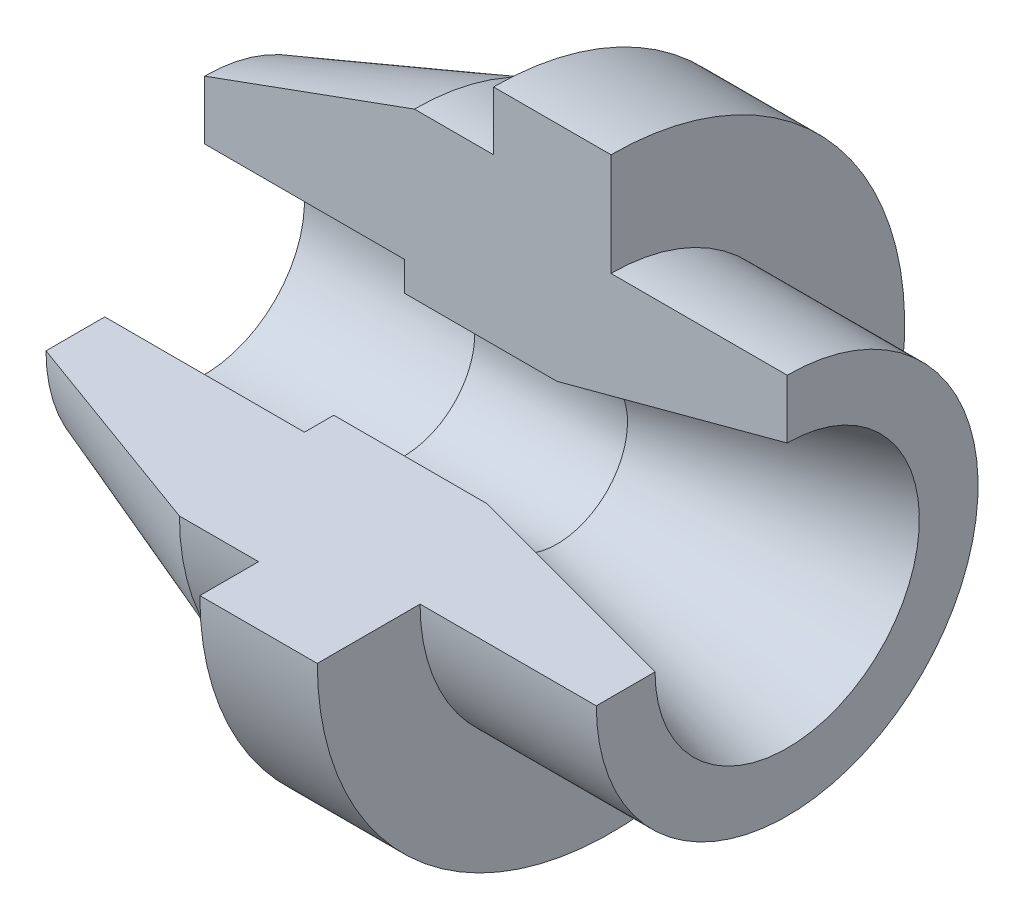
ISO-10303-21;
HEADER;
FILE_DESCRIPTION(('STEP AP214'),'2;1');
FILE_NAME('part.step','',(''),(''),'','','');
FILE_SCHEMA(('AUTOMOTIVE_DESIGN { 1 0 10303 214 1 1 1 1 }'));
ENDSEC;
DATA;
#1=APPLICATION_CONTEXT('core data for automotive mechanical design processes');
#2=APPLICATION_PROTOCOL_DEFINITION('international standard','automotive_design',2000,#1);
#3=PRODUCT_CONTEXT('',#1,'mechanical');
#4=PRODUCT('Part','Part','',(#3));
#5=PRODUCT_RELATED_PRODUCT_CATEGORY('part','',(#4));
#6=PRODUCT_DEFINITION_FORMATION('','',#4);
#7=PRODUCT_DEFINITION_CONTEXT('part definition',#1,'design');
#8=PRODUCT_DEFINITION('design','',#6,#7);
#9=PRODUCT_DEFINITION_SHAPE('','',#8);
#10=(LENGTH_UNIT() NAMED_UNIT(*) SI_UNIT(.MILLI.,.METRE.));
#11=(NAMED_UNIT(*) PLANE_ANGLE_UNIT() SI_UNIT($,.RADIAN.));
#12=(NAMED_UNIT(*) SI_UNIT($,.STERADIAN.) SOLID_ANGLE_UNIT());
#13=UNCERTAINTY_MEASURE_WITH_UNIT(LENGTH_MEASURE(1.E-05),#10,'distance_accuracy_value','');
#14=(GEOMETRIC_REPRESENTATION_CONTEXT(3) GLOBAL_UNCERTAINTY_ASSIGNED_CONTEXT((#13)) GLOBAL_UNIT_ASSIGNED_CONTEXT((#10,
#11,#12)) REPRESENTATION_CONTEXT('',''));
#15=CARTESIAN_POINT('',(0.,0.,0.));
#16=DIRECTION('',(0.,0.,1.));
#17=DIRECTION('',(1.,0.,0.));
#18=AXIS2_PLACEMENT_3D('',#15,#16,#17);
#19=CARTESIAN_POINT('',(0.,0.,0.));
#20=DIRECTION('',(-1.,0.,0.));
#21=DIRECTION('',(0.,0.,1.));
#22=AXIS2_PLACEMENT_3D('',#19,#20,#21);
#23=CYLINDRICAL_SURFACE('',#22,17.);
#24=CARTESIAN_POINT('',(0.,0.,0.));
#25=DIRECTION('',(-1.,0.,0.));
#26=DIRECTION('',(0.,0.,1.));
#27=AXIS2_PLACEMENT_3D('',#24,#25,#26);
#28=CIRCLE('',#27,17.);
#29=CARTESIAN_POINT('',(0.,17.,1.78065548281E-13));
#30=VERTEX_POINT('',#29);
#31=CARTESIAN_POINT('',(0.,0.,17.));
#32=VERTEX_POINT('',#31);
#33=EDGE_CURVE('E11',#30,#32,#28,.T.);
#34=ORIENTED_EDGE('',*,*,#33,.T.);
#35=DIRECTION('',(-1.,0.,0.));
#36=VECTOR('',#35,1.);
#37=CARTESIAN_POINT('',(34.,0.,17.));
#38=LINE('',#37,#36);
#39=CARTESIAN_POINT('',(34.,0.,17.));
#40=VERTEX_POINT('',#39);
#41=EDGE_CURVE('E132',#40,#32,#38,.T.);
#42=ORIENTED_EDGE('',*,*,#41,.F.);
#43=CARTESIAN_POINT('',(34.,0.,0.));
#44=DIRECTION('',(-1.,0.,0.));
#45=DIRECTION('',(0.,0.,1.));
#46=AXIS2_PLACEMENT_3D('',#43,#44,#45);
#47=CIRCLE('',#46,17.);
#48=CARTESIAN_POINT('',(34.,17.,1.78065548281E-13));
#49=VERTEX_POINT('',#48);
#50=EDGE_CURVE('E59',#49,#40,#47,.T.);
#51=ORIENTED_EDGE('',*,*,#50,.F.);
#52=DIRECTION('',(-1.,0.,0.));
#53=VECTOR('',#52,1.);
#54=CARTESIAN_POINT('',(34.,17.,1.78065548281E-13));
#55=LINE('',#54,#53);
#56=EDGE_CURVE('E134',#49,#30,#55,.T.);
#57=ORIENTED_EDGE('',*,*,#56,.T.);
#58=EDGE_LOOP('',(#34,#42,#51,#57));
#59=FACE_BOUND('',#58,.T.);
#60=ADVANCED_FACE('F43',(#59),#23,.F.);
#61=CARTESIAN_POINT('',(0.,17.,1.78065548281E-13));
#62=DIRECTION('',(-1.,0.,0.));
#63=DIRECTION('',(0.,0.,1.));
#64=AXIS2_PLACEMENT_3D('',#61,#62,#63);
#65=PLANE('',#64);
#66=CARTESIAN_POINT('',(0.,0.,0.));
#67=DIRECTION('',(-1.,0.,0.));
#68=DIRECTION('',(0.,0.,1.));
#69=AXIS2_PLACEMENT_3D('',#66,#67,#68);
#70=CIRCLE('',#69,27.);
#71=CARTESIAN_POINT('',(0.,27.,2.82809988446294E-13));
#72=VERTEX_POINT('',#71);
#73=CARTESIAN_POINT('',(0.,0.,27.));
#74=VERTEX_POINT('',#73);
#75=EDGE_CURVE('E52',#72,#74,#70,.T.);
#76=ORIENTED_EDGE('',*,*,#75,.T.);
#77=DIRECTION('',(0.,0.,1.));
#78=VECTOR('',#77,1.);
#79=CARTESIAN_POINT('',(0.,0.,17.));
#80=LINE('',#79,#78);
#81=EDGE_CURVE('E143',#32,#74,#80,.T.);
#82=ORIENTED_EDGE('',*,*,#81,.F.);
#83=ORIENTED_EDGE('',*,*,#33,.F.);
#84=DIRECTION('',(0.,1.,0.));
#85=VECTOR('',#84,1.);
#86=CARTESIAN_POINT('',(0.,17.,1.78065548281E-13));
#87=LINE('',#86,#85);
#88=EDGE_CURVE('E190',#30,#72,#87,.T.);
#89=ORIENTED_EDGE('',*,*,#88,.T.);
#90=EDGE_LOOP('',(#76,#82,#83,#89));
#91=FACE_BOUND('',#90,.T.);
#92=ADVANCED_FACE('F45',(#91),#65,.T.);
#93=CARTESIAN_POINT('',(0.,0.,0.));
#94=DIRECTION('',(1.,0.,0.));
#95=DIRECTION('',(0.,0.,-1.));
#96=AXIS2_PLACEMENT_3D('',#93,#94,#95);
#97=CONICAL_SURFACE('',#96,27.,0.349065850398862);
#98=CARTESIAN_POINT('',(35.7172064529105,0.,0.));
#99=DIRECTION('',(-1.,0.,0.));
#100=DIRECTION('',(0.,0.,1.));
#101=AXIS2_PLACEMENT_3D('',#98,#99,#100);
#102=CIRCLE('',#101,40.);
#103=CARTESIAN_POINT('',(35.7172064529105,40.,4.18977760661176E-13));
#104=VERTEX_POINT('',#103);
#105=CARTESIAN_POINT('',(35.7172064529105,0.,40.));
#106=VERTEX_POINT('',#105);
#107=EDGE_CURVE('E256',#104,#106,#102,.T.);
#108=ORIENTED_EDGE('',*,*,#107,.T.);
#109=DIRECTION('',(0.93969262078591,0.,0.342020143325665));
#110=VECTOR('',#109,1.);
#111=CARTESIAN_POINT('',(0.,0.,27.));
#112=LINE('',#111,#110);
#113=EDGE_CURVE('E150',#74,#106,#112,.T.);
#114=ORIENTED_EDGE('',*,*,#113,.F.);
#115=ORIENTED_EDGE('',*,*,#75,.F.);
#116=DIRECTION('',(0.93969262078591,0.342020143325665,0.));
#117=VECTOR('',#116,1.);
#118=CARTESIAN_POINT('',(0.,27.,2.82809988446294E-13));
#119=LINE('',#118,#117);
#120=EDGE_CURVE('E193',#72,#104,#119,.T.);
#121=ORIENTED_EDGE('',*,*,#120,.T.);
#122=EDGE_LOOP('',(#108,#114,#115,#121));
#123=FACE_BOUND('',#122,.T.);
#124=ADVANCED_FACE('F260',(#123),#97,.T.);
#125=CARTESIAN_POINT('',(0.,0.,0.));
#126=DIRECTION('',(-1.,0.,0.));
#127=DIRECTION('',(0.,0.,1.));
#128=AXIS2_PLACEMENT_3D('',#125,#126,#127);
#129=CYLINDRICAL_SURFACE('',#128,40.);
#130=CARTESIAN_POINT('',(49.1865334794743,0.,0.));
#131=DIRECTION('',(-1.,0.,0.));
#132=DIRECTION('',(0.,0.,1.));
#133=AXIS2_PLACEMENT_3D('',#130,#131,#132);
#134=CIRCLE('',#133,40.);
#135=CARTESIAN_POINT('',(49.1865334794743,40.,4.18977760661176E-13));
#136=VERTEX_POINT('',#135);
#137=CARTESIAN_POINT('',(49.1865334794743,0.,40.));
#138=VERTEX_POINT('',#137);
#139=EDGE_CURVE('E253',#136,#138,#134,.T.);
#140=ORIENTED_EDGE('',*,*,#139,.T.);
#141=DIRECTION('',(1.,0.,0.));
#142=VECTOR('',#141,1.);
#143=CARTESIAN_POINT('',(35.7172064529105,0.,40.));
#144=LINE('',#143,#142);
#145=EDGE_CURVE('E153',#106,#138,#144,.T.);
#146=ORIENTED_EDGE('',*,*,#145,.F.);
#147=ORIENTED_EDGE('',*,*,#107,.F.);
#148=DIRECTION('',(1.,0.,0.));
#149=VECTOR('',#148,1.);
#150=CARTESIAN_POINT('',(35.7172064529105,40.,4.18977760661176E-13));
#151=LINE('',#150,#149);
#152=EDGE_CURVE('E197',#104,#136,#151,.T.);
#153=ORIENTED_EDGE('',*,*,#152,.T.);
#154=EDGE_LOOP('',(#140,#146,#147,#153));
#155=FACE_BOUND('',#154,.T.);
#156=ADVANCED_FACE('F266',(#155),#129,.T.);
#157=CARTESIAN_POINT('',(49.1865334794743,40.,4.18977760661176E-13));
#158=DIRECTION('',(-1.,0.,0.));
#159=DIRECTION('',(0.,0.,1.));
#160=AXIS2_PLACEMENT_3D('',#157,#158,#159);
#161=PLANE('',#160);
#162=CARTESIAN_POINT('',(49.1865334794743,0.,0.));
#163=DIRECTION('',(-1.,0.,0.));
#164=DIRECTION('',(0.,0.,1.));
#165=AXIS2_PLACEMENT_3D('',#162,#163,#164);
#166=CIRCLE('',#165,50.);
#167=CARTESIAN_POINT('',(49.1865334794743,50.,5.2372220082647E-13));
#168=VERTEX_POINT('',#167);
#169=CARTESIAN_POINT('',(49.1865334794743,0.,50.));
#170=VERTEX_POINT('',#169);
#171=EDGE_CURVE('E250',#168,#170,#166,.T.);
#172=ORIENTED_EDGE('',*,*,#171,.T.);
#173=DIRECTION('',(0.,0.,1.));
#174=VECTOR('',#173,1.);
#175=CARTESIAN_POINT('',(49.1865334794743,0.,40.));
#176=LINE('',#175,#174);
#177=EDGE_CURVE('E159',#138,#170,#176,.T.);
#178=ORIENTED_EDGE('',*,*,#177,.F.);
#179=ORIENTED_EDGE('',*,*,#139,.F.);
#180=DIRECTION('',(0.,1.,0.));
#181=VECTOR('',#180,1.);
#182=CARTESIAN_POINT('',(49.1865334794743,40.,4.18977760661176E-13));
#183=LINE('',#182,#181);
#184=EDGE_CURVE('E201',#136,#168,#183,.T.);
#185=ORIENTED_EDGE('',*,*,#184,.T.);
#186=EDGE_LOOP('',(#172,#178,#179,#185));
#187=FACE_BOUND('',#186,.T.);
#188=ADVANCED_FACE('F269',(#187),#161,.T.);
#189=CARTESIAN_POINT('',(0.,0.,0.));
#190=DIRECTION('',(-1.,0.,0.));
#191=DIRECTION('',(0.,0.,1.));
#192=AXIS2_PLACEMENT_3D('',#189,#190,#191);
#193=CYLINDRICAL_SURFACE('',#192,50.);
#194=CARTESIAN_POINT('',(69.1865334794743,0.,0.));
#195=DIRECTION('',(-1.,0.,0.));
#196=DIRECTION('',(0.,0.,1.));
#197=AXIS2_PLACEMENT_3D('',#194,#195,#196);
#198=CIRCLE('',#197,50.);
#199=CARTESIAN_POINT('',(69.1865334794743,50.,5.2372220082647E-13));
#200=VERTEX_POINT('',#199);
#201=CARTESIAN_POINT('',(69.1865334794743,0.,50.));
#202=VERTEX_POINT('',#201);
#203=EDGE_CURVE('E247',#200,#202,#198,.T.);
#204=ORIENTED_EDGE('',*,*,#203,.T.);
#205=DIRECTION('',(1.,0.,0.));
#206=VECTOR('',#205,1.);
#207=CARTESIAN_POINT('',(49.1865334794743,0.,50.));
#208=LINE('',#207,#206);
#209=EDGE_CURVE('E163',#170,#202,#208,.T.);
#210=ORIENTED_EDGE('',*,*,#209,.F.);
#211=ORIENTED_EDGE('',*,*,#171,.F.);
#212=DIRECTION('',(1.,0.,0.));
#213=VECTOR('',#212,1.);
#214=CARTESIAN_POINT('',(49.1865334794743,50.,5.2372220082647E-13));
#215=LINE('',#214,#213);
#216=EDGE_CURVE('E205',#168,#200,#215,.T.);
#217=ORIENTED_EDGE('',*,*,#216,.T.);
#218=EDGE_LOOP('',(#204,#210,#211,#217));
#219=FACE_BOUND('',#218,.T.);
#220=ADVANCED_FACE('F274',(#219),#193,.T.);
#221=CARTESIAN_POINT('',(69.1865334794743,50.,5.2372220082647E-13));
#222=DIRECTION('',(1.,0.,0.));
#223=DIRECTION('',(0.,0.,-1.));
#224=AXIS2_PLACEMENT_3D('',#221,#222,#223);
#225=PLANE('',#224);
#226=CARTESIAN_POINT('',(69.1865334794743,0.,0.));
#227=DIRECTION('',(-1.,0.,0.));
#228=DIRECTION('',(0.,0.,1.));
#229=AXIS2_PLACEMENT_3D('',#226,#227,#228);
#230=CIRCLE('',#229,32.5);
#231=CARTESIAN_POINT('',(69.1865334794743,32.5,3.40419430537206E-13));
#232=VERTEX_POINT('',#231);
#233=CARTESIAN_POINT('',(69.1865334794743,0.,32.5));
#234=VERTEX_POINT('',#233);
#235=EDGE_CURVE('E244',#232,#234,#230,.T.);
#236=ORIENTED_EDGE('',*,*,#235,.T.);
#237=DIRECTION('',(0.,0.,-1.));
#238=VECTOR('',#237,1.);
#239=CARTESIAN_POINT('',(69.1865334794743,0.,50.));
#240=LINE('',#239,#238);
#241=EDGE_CURVE('E167',#202,#234,#240,.T.);
#242=ORIENTED_EDGE('',*,*,#241,.F.);
#243=ORIENTED_EDGE('',*,*,#203,.F.);
#244=DIRECTION('',(0.,-1.,0.));
#245=VECTOR('',#244,1.);
#246=CARTESIAN_POINT('',(69.1865334794743,50.,5.2372220082647E-13));
#247=LINE('',#246,#245);
#248=EDGE_CURVE('E209',#200,#232,#247,.T.);
#249=ORIENTED_EDGE('',*,*,#248,.T.);
#250=EDGE_LOOP('',(#236,#242,#243,#249));
#251=FACE_BOUND('',#250,.T.);
#252=ADVANCED_FACE('F277',(#251),#225,.T.);
#253=CARTESIAN_POINT('',(0.,0.,0.));
#254=DIRECTION('',(-1.,0.,0.));
#255=DIRECTION('',(0.,0.,1.));
#256=AXIS2_PLACEMENT_3D('',#253,#254,#255);
#257=CYLINDRICAL_SURFACE('',#256,32.5);
#258=CARTESIAN_POINT('',(99.1865334794743,0.,0.));
#259=DIRECTION('',(-1.,0.,0.));
#260=DIRECTION('',(0.,0.,1.));
#261=AXIS2_PLACEMENT_3D('',#258,#259,#260);
#262=CIRCLE('',#261,32.5);
#263=CARTESIAN_POINT('',(99.1865334794743,32.5,3.40419430537206E-13));
#264=VERTEX_POINT('',#263);
#265=CARTESIAN_POINT('',(99.1865334794743,0.,32.5));
#266=VERTEX_POINT('',#265);
#267=EDGE_CURVE('E241',#264,#266,#262,.T.);
#268=ORIENTED_EDGE('',*,*,#267,.T.);
#269=DIRECTION('',(1.,0.,0.));
#270=VECTOR('',#269,1.);
#271=CARTESIAN_POINT('',(69.1865334794743,0.,32.5));
#272=LINE('',#271,#270);
#273=EDGE_CURVE('E171',#234,#266,#272,.T.);
#274=ORIENTED_EDGE('',*,*,#273,.F.);
#275=ORIENTED_EDGE('',*,*,#235,.F.);
#276=DIRECTION('',(1.,0.,0.));
#277=VECTOR('',#276,1.);
#278=CARTESIAN_POINT('',(69.1865334794743,32.5,3.40419430537206E-13));
#279=LINE('',#278,#277);
#280=EDGE_CURVE('E213',#232,#264,#279,.T.);
#281=ORIENTED_EDGE('',*,*,#280,.T.);
#282=EDGE_LOOP('',(#268,#274,#275,#281));
#283=FACE_BOUND('',#282,.T.);
#284=ADVANCED_FACE('F282',(#283),#257,.T.);
#285=CARTESIAN_POINT('',(99.1865334794743,32.5,3.40419430537206E-13));
#286=DIRECTION('',(1.,0.,0.));
#287=DIRECTION('',(0.,0.,-1.));
#288=AXIS2_PLACEMENT_3D('',#285,#286,#287);
#289=PLANE('',#288);
#290=CARTESIAN_POINT('',(99.1865334794743,0.,0.));
#291=DIRECTION('',(-1.,0.,0.));
#292=DIRECTION('',(0.,0.,1.));
#293=AXIS2_PLACEMENT_3D('',#290,#291,#292);
#294=CIRCLE('',#293,22.5);
#295=CARTESIAN_POINT('',(99.1865334794743,22.5,2.35674990371912E-13));
#296=VERTEX_POINT('',#295);
#297=CARTESIAN_POINT('',(99.1865334794743,0.,22.5));
#298=VERTEX_POINT('',#297);
#299=EDGE_CURVE('E238',#296,#298,#294,.T.);
#300=ORIENTED_EDGE('',*,*,#299,.T.);
#301=DIRECTION('',(0.,0.,-1.));
#302=VECTOR('',#301,1.);
#303=CARTESIAN_POINT('',(99.1865334794743,0.,32.5));
#304=LINE('',#303,#302);
#305=EDGE_CURVE('E175',#266,#298,#304,.T.);
#306=ORIENTED_EDGE('',*,*,#305,.F.);
#307=ORIENTED_EDGE('',*,*,#267,.F.);
#308=DIRECTION('',(0.,-1.,0.));
#309=VECTOR('',#308,1.);
#310=CARTESIAN_POINT('',(99.1865334794743,32.5,3.40419430537206E-13));
#311=LINE('',#310,#309);
#312=EDGE_CURVE('E217',#264,#296,#311,.T.);
#313=ORIENTED_EDGE('',*,*,#312,.T.);
#314=EDGE_LOOP('',(#300,#306,#307,#313));
#315=FACE_BOUND('',#314,.T.);
#316=ADVANCED_FACE('F285',(#315),#289,.T.);
#317=CARTESIAN_POINT('',(99.1865334794743,0.,0.));
#318=DIRECTION('',(1.,0.,0.));
#319=DIRECTION('',(0.,0.,-1.));
#320=AXIS2_PLACEMENT_3D('',#317,#318,#319);
#321=CONICAL_SURFACE('',#320,22.5,0.261799387799143);
#322=CARTESIAN_POINT('',(60.,0.,0.));
#323=DIRECTION('',(-1.,0.,0.));
#324=DIRECTION('',(0.,0.,1.));
#325=AXIS2_PLACEMENT_3D('',#322,#323,#324);
#326=CIRCLE('',#325,12.);
#327=CARTESIAN_POINT('',(60.,12.,1.25693328198353E-13));
#328=VERTEX_POINT('',#327);
#329=CARTESIAN_POINT('',(60.,0.,12.));
#330=VERTEX_POINT('',#329);
#331=EDGE_CURVE('E235',#328,#330,#326,.T.);
#332=ORIENTED_EDGE('',*,*,#331,.T.);
#333=DIRECTION('',(-0.96592582628907,0.,-0.258819045102514));
#334=VECTOR('',#333,1.);
#335=CARTESIAN_POINT('',(99.1865334794743,0.,22.5));
#336=LINE('',#335,#334);
#337=EDGE_CURVE('E179',#298,#330,#336,.T.);
#338=ORIENTED_EDGE('',*,*,#337,.F.);
#339=ORIENTED_EDGE('',*,*,#299,.F.);
#340=DIRECTION('',(-0.96592582628907,-0.258819045102514,0.));
#341=VECTOR('',#340,1.);
#342=CARTESIAN_POINT('',(99.1865334794743,22.5,2.35674990371912E-13));
#343=LINE('',#342,#341);
#344=EDGE_CURVE('E221',#296,#328,#343,.T.);
#345=ORIENTED_EDGE('',*,*,#344,.T.);
#346=EDGE_LOOP('',(#332,#338,#339,#345));
#347=FACE_BOUND('',#346,.T.);
#348=ADVANCED_FACE('F290',(#347),#321,.F.);
#349=CARTESIAN_POINT('',(0.,0.,0.));
#350=DIRECTION('',(-1.,0.,0.));
#351=DIRECTION('',(0.,0.,1.));
#352=AXIS2_PLACEMENT_3D('',#349,#350,#351);
#353=CYLINDRICAL_SURFACE('',#352,12.);
#354=CARTESIAN_POINT('',(34.,0.,0.));
#355=DIRECTION('',(-1.,0.,0.));
#356=DIRECTION('',(0.,0.,1.));
#357=AXIS2_PLACEMENT_3D('',#354,#355,#356);
#358=CIRCLE('',#357,12.);
#359=CARTESIAN_POINT('',(34.,12.,1.25693328198353E-13));
#360=VERTEX_POINT('',#359);
#361=CARTESIAN_POINT('',(34.,0.,12.));
#362=VERTEX_POINT('',#361);
#363=EDGE_CURVE('E67',#360,#362,#358,.T.);
#364=ORIENTED_EDGE('',*,*,#363,.T.);
#365=DIRECTION('',(-1.,0.,0.));
#366=VECTOR('',#365,1.);
#367=CARTESIAN_POINT('',(60.,0.,12.));
#368=LINE('',#367,#366);
#369=EDGE_CURVE('E183',#330,#362,#368,.T.);
#370=ORIENTED_EDGE('',*,*,#369,.F.);
#371=ORIENTED_EDGE('',*,*,#331,.F.);
#372=DIRECTION('',(-1.,0.,0.));
#373=VECTOR('',#372,1.);
#374=CARTESIAN_POINT('',(60.,12.,1.25693328198353E-13));
#375=LINE('',#374,#373);
#376=EDGE_CURVE('E225',#328,#360,#375,.T.);
#377=ORIENTED_EDGE('',*,*,#376,.T.);
#378=EDGE_LOOP('',(#364,#370,#371,#377));
#379=FACE_BOUND('',#378,.T.);
#380=ADVANCED_FACE('F293',(#379),#353,.F.);
#381=CARTESIAN_POINT('',(34.,12.,1.25693328198353E-13));
#382=DIRECTION('',(-1.,0.,0.));
#383=DIRECTION('',(0.,0.,1.));
#384=AXIS2_PLACEMENT_3D('',#381,#382,#383);
#385=PLANE('',#384);
#386=DIRECTION('',(0.,1.,0.));
#387=VECTOR('',#386,1.);
#388=CARTESIAN_POINT('',(34.,12.,1.25693328198353E-13));
#389=LINE('',#388,#387);
#390=EDGE_CURVE('E228',#360,#49,#389,.T.);
#391=ORIENTED_EDGE('',*,*,#390,.T.);
#392=ORIENTED_EDGE('',*,*,#50,.T.);
#393=DIRECTION('',(0.,0.,1.));
#394=VECTOR('',#393,1.);
#395=CARTESIAN_POINT('',(34.,0.,12.));
#396=LINE('',#395,#394);
#397=EDGE_CURVE('E146',#362,#40,#396,.T.);
#398=ORIENTED_EDGE('',*,*,#397,.F.);
#399=ORIENTED_EDGE('',*,*,#363,.F.);
#400=EDGE_LOOP('',(#391,#392,#398,#399));
#401=FACE_BOUND('',#400,.T.);
#402=ADVANCED_FACE('F295',(#401),#385,.T.);
#403=CARTESIAN_POINT('',(0.,0.,0.));
#404=DIRECTION('',(0.,0.,-1.));
#405=DIRECTION('',(0.,1.,0.));
#406=AXIS2_PLACEMENT_3D('',#403,#404,#405);
#407=PLANE('',#406);
#408=ORIENTED_EDGE('',*,*,#56,.F.);
#409=ORIENTED_EDGE('',*,*,#390,.F.);
#410=ORIENTED_EDGE('',*,*,#376,.F.);
#411=ORIENTED_EDGE('',*,*,#344,.F.);
#412=ORIENTED_EDGE('',*,*,#312,.F.);
#413=ORIENTED_EDGE('',*,*,#280,.F.);
#414=ORIENTED_EDGE('',*,*,#248,.F.);
#415=ORIENTED_EDGE('',*,*,#216,.F.);
#416=ORIENTED_EDGE('',*,*,#184,.F.);
#417=ORIENTED_EDGE('',*,*,#152,.F.);
#418=ORIENTED_EDGE('',*,*,#120,.F.);
#419=ORIENTED_EDGE('',*,*,#88,.F.);
#420=EDGE_LOOP('',(#408,#409,#410,#411,#412,#413,#414,#415,#416,#417,#418,#419));
#421=FACE_BOUND('',#420,.T.);
#422=ADVANCED_FACE('F297',(#421),#407,.F.);
#423=CARTESIAN_POINT('',(0.,0.,0.));
#424=DIRECTION('',(0.,1.,0.));
#425=DIRECTION('',(0.,0.,1.));
#426=AXIS2_PLACEMENT_3D('',#423,#424,#425);
#427=PLANE('',#426);
#428=ORIENTED_EDGE('',*,*,#41,.T.);
#429=ORIENTED_EDGE('',*,*,#81,.T.);
#430=ORIENTED_EDGE('',*,*,#113,.T.);
#431=ORIENTED_EDGE('',*,*,#145,.T.);
#432=ORIENTED_EDGE('',*,*,#177,.T.);
#433=ORIENTED_EDGE('',*,*,#209,.T.);
#434=ORIENTED_EDGE('',*,*,#241,.T.);
#435=ORIENTED_EDGE('',*,*,#273,.T.);
#436=ORIENTED_EDGE('',*,*,#305,.T.);
#437=ORIENTED_EDGE('',*,*,#337,.T.);
#438=ORIENTED_EDGE('',*,*,#369,.T.);
#439=ORIENTED_EDGE('',*,*,#397,.T.);
#440=EDGE_LOOP('',(#428,#429,#430,#431,#432,#433,#434,#435,#436,#437,#438,#439));
#441=FACE_BOUND('',#440,.T.);
#442=ADVANCED_FACE('F141',(#441),#427,.T.);
#443=CLOSED_SHELL('',(#60,#92,#124,#156,#188,#220,#252,#284,#316,#348,#380,#402,#422,#442));
#444=MANIFOLD_SOLID_BREP('B2',#443);
#445=ADVANCED_BREP_SHAPE_REPRESENTATION('',(#18,#444),#14);
#446=SHAPE_DEFINITION_REPRESENTATION(#9,#445);
ENDSEC;
END-ISO-10303-21;
